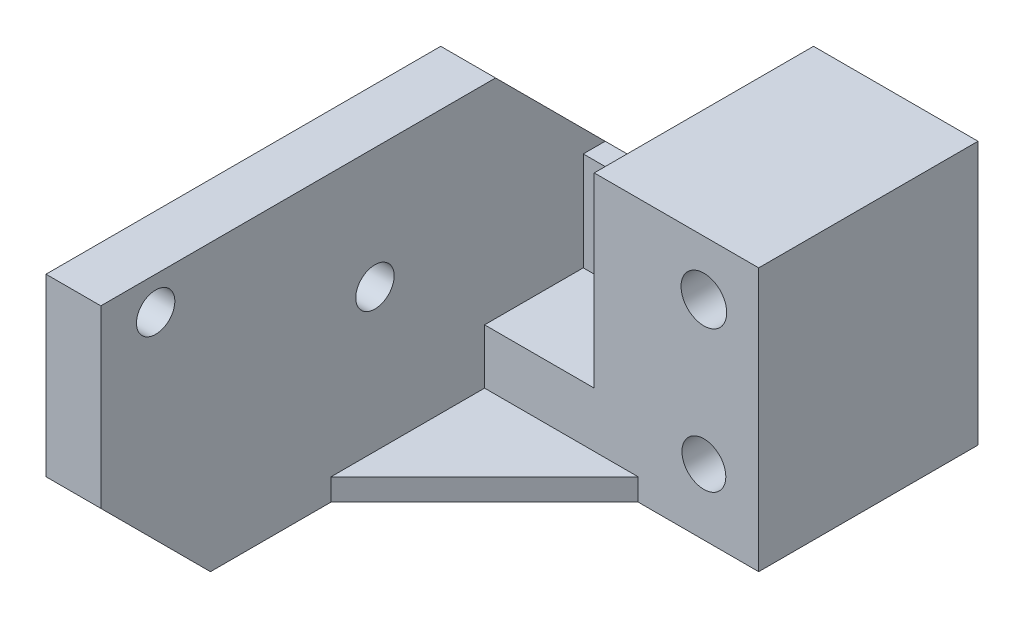
ISO-10303-21;
HEADER;
FILE_DESCRIPTION(('STEP AP214'),'2;1');
FILE_NAME('part.step','',(''),(''),'','','');
FILE_SCHEMA(('AUTOMOTIVE_DESIGN { 1 0 10303 214 1 1 1 1 }'));
ENDSEC;
DATA;
#1=APPLICATION_CONTEXT('core data for automotive mechanical design processes');
#2=APPLICATION_PROTOCOL_DEFINITION('international standard','automotive_design',2000,#1);
#3=PRODUCT_CONTEXT('',#1,'mechanical');
#4=PRODUCT('Part','Part','',(#3));
#5=PRODUCT_RELATED_PRODUCT_CATEGORY('part','',(#4));
#6=PRODUCT_DEFINITION_FORMATION('','',#4);
#7=PRODUCT_DEFINITION_CONTEXT('part definition',#1,'design');
#8=PRODUCT_DEFINITION('design','',#6,#7);
#9=PRODUCT_DEFINITION_SHAPE('','',#8);
#10=(LENGTH_UNIT() NAMED_UNIT(*) SI_UNIT(.MILLI.,.METRE.));
#11=(NAMED_UNIT(*) PLANE_ANGLE_UNIT() SI_UNIT($,.RADIAN.));
#12=(NAMED_UNIT(*) SI_UNIT($,.STERADIAN.) SOLID_ANGLE_UNIT());
#13=UNCERTAINTY_MEASURE_WITH_UNIT(LENGTH_MEASURE(1.E-05),#10,'distance_accuracy_value','');
#14=(GEOMETRIC_REPRESENTATION_CONTEXT(3) GLOBAL_UNCERTAINTY_ASSIGNED_CONTEXT((#13)) GLOBAL_UNIT_ASSIGNED_CONTEXT((#10,
#11,#12)) REPRESENTATION_CONTEXT('',''));
#15=CARTESIAN_POINT('',(0.,0.,0.));
#16=DIRECTION('',(0.,0.,1.));
#17=DIRECTION('',(1.,0.,0.));
#18=AXIS2_PLACEMENT_3D('',#15,#16,#17);
#19=CARTESIAN_POINT('',(30.,12.,0.));
#20=DIRECTION('',(0.,0.,-1.));
#21=DIRECTION('',(-1.,0.,0.));
#22=AXIS2_PLACEMENT_3D('',#19,#20,#21);
#23=PLANE('',#22);
#24=CARTESIAN_POINT('',(25.,19.,0.));
#25=DIRECTION('',(0.,0.,1.));
#26=DIRECTION('',(1.,0.,0.));
#27=AXIS2_PLACEMENT_3D('',#24,#25,#26);
#28=CIRCLE('',#27,2.08412794298633);
#29=CARTESIAN_POINT('',(27.0841279429863,19.,0.));
#30=VERTEX_POINT('',#29);
#31=EDGE_CURVE('E175',#30,#30,#28,.T.);
#32=ORIENTED_EDGE('',*,*,#31,.F.);
#33=EDGE_LOOP('',(#32));
#34=FACE_BOUND('',#33,.T.);
#35=CARTESIAN_POINT('',(25.,6.,0.));
#36=DIRECTION('',(0.,0.,1.));
#37=DIRECTION('',(1.,0.,0.));
#38=AXIS2_PLACEMENT_3D('',#35,#36,#37);
#39=CIRCLE('',#38,2.);
#40=CARTESIAN_POINT('',(27.,6.,0.));
#41=VERTEX_POINT('',#40);
#42=EDGE_CURVE('E183',#41,#41,#39,.T.);
#43=ORIENTED_EDGE('',*,*,#42,.F.);
#44=EDGE_LOOP('',(#43));
#45=FACE_BOUND('',#44,.T.);
#46=DIRECTION('',(0.,-1.,0.));
#47=VECTOR('',#46,1.);
#48=CARTESIAN_POINT('',(15.,24.,0.));
#49=LINE('',#48,#47);
#50=CARTESIAN_POINT('',(15.,24.,0.));
#51=VERTEX_POINT('',#50);
#52=CARTESIAN_POINT('',(15.,7.,0.));
#53=VERTEX_POINT('',#52);
#54=EDGE_CURVE('E174',#51,#53,#49,.T.);
#55=ORIENTED_EDGE('',*,*,#54,.T.);
#56=DIRECTION('',(-1.,0.,0.));
#57=VECTOR('',#56,1.);
#58=CARTESIAN_POINT('',(30.,7.,0.));
#59=LINE('',#58,#57);
#60=CARTESIAN_POINT('',(5.,7.,0.));
#61=VERTEX_POINT('',#60);
#62=EDGE_CURVE('E160',#53,#61,#59,.T.);
#63=ORIENTED_EDGE('',*,*,#62,.T.);
#64=DIRECTION('',(0.,-1.,0.));
#65=VECTOR('',#64,1.);
#66=CARTESIAN_POINT('',(5.,12.,0.));
#67=LINE('',#66,#65);
#68=CARTESIAN_POINT('',(5.,2.,0.));
#69=VERTEX_POINT('',#68);
#70=EDGE_CURVE('E171',#61,#69,#67,.T.);
#71=ORIENTED_EDGE('',*,*,#70,.T.);
#72=DIRECTION('',(1.,0.,0.));
#73=VECTOR('',#72,1.);
#74=CARTESIAN_POINT('',(19.,2.,0.));
#75=LINE('',#74,#73);
#76=CARTESIAN_POINT('',(19.,2.,0.));
#77=VERTEX_POINT('',#76);
#78=EDGE_CURVE('E291',#69,#77,#75,.T.);
#79=ORIENTED_EDGE('',*,*,#78,.T.);
#80=DIRECTION('',(0.,-1.,0.));
#81=VECTOR('',#80,1.);
#82=CARTESIAN_POINT('',(19.,2.,0.));
#83=LINE('',#82,#81);
#84=CARTESIAN_POINT('',(19.,0.,0.));
#85=VERTEX_POINT('',#84);
#86=EDGE_CURVE('E296',#77,#85,#83,.T.);
#87=ORIENTED_EDGE('',*,*,#86,.T.);
#88=DIRECTION('',(1.,0.,0.));
#89=VECTOR('',#88,1.);
#90=CARTESIAN_POINT('',(30.,0.,0.));
#91=LINE('',#90,#89);
#92=CARTESIAN_POINT('',(30.,0.,0.));
#93=VERTEX_POINT('',#92);
#94=EDGE_CURVE('E196',#85,#93,#91,.T.);
#95=ORIENTED_EDGE('',*,*,#94,.T.);
#96=DIRECTION('',(0.,-1.,0.));
#97=VECTOR('',#96,1.);
#98=CARTESIAN_POINT('',(30.,12.,0.));
#99=LINE('',#98,#97);
#100=CARTESIAN_POINT('',(30.,24.,0.));
#101=VERTEX_POINT('',#100);
#102=EDGE_CURVE('E212',#101,#93,#99,.T.);
#103=ORIENTED_EDGE('',*,*,#102,.F.);
#104=DIRECTION('',(1.,0.,0.));
#105=VECTOR('',#104,1.);
#106=CARTESIAN_POINT('',(15.,24.,0.));
#107=LINE('',#106,#105);
#108=EDGE_CURVE('E279',#51,#101,#107,.T.);
#109=ORIENTED_EDGE('',*,*,#108,.F.);
#110=EDGE_LOOP('',(#55,#63,#71,#79,#87,#95,#103,#109));
#111=FACE_BOUND('',#110,.T.);
#112=ADVANCED_FACE('F35',(#34,#45,#111),#23,.F.);
#113=CARTESIAN_POINT('',(30.,12.,-20.));
#114=DIRECTION('',(-1.,0.,0.));
#115=DIRECTION('',(0.,0.,1.));
#116=AXIS2_PLACEMENT_3D('',#113,#114,#115);
#117=PLANE('',#116);
#118=DIRECTION('',(0.,0.,-1.));
#119=VECTOR('',#118,1.);
#120=CARTESIAN_POINT('',(30.,0.,-20.));
#121=LINE('',#120,#119);
#122=CARTESIAN_POINT('',(30.,0.,-20.));
#123=VERTEX_POINT('',#122);
#124=EDGE_CURVE('E198',#93,#123,#121,.T.);
#125=ORIENTED_EDGE('',*,*,#124,.T.);
#126=DIRECTION('',(0.,-1.,0.));
#127=VECTOR('',#126,1.);
#128=CARTESIAN_POINT('',(30.,12.,-20.));
#129=LINE('',#128,#127);
#130=CARTESIAN_POINT('',(30.,24.,-20.));
#131=VERTEX_POINT('',#130);
#132=EDGE_CURVE('E209',#131,#123,#129,.T.);
#133=ORIENTED_EDGE('',*,*,#132,.F.);
#134=DIRECTION('',(0.,0.,-1.));
#135=VECTOR('',#134,1.);
#136=CARTESIAN_POINT('',(30.,24.,-20.));
#137=LINE('',#136,#135);
#138=EDGE_CURVE('E282',#101,#131,#137,.T.);
#139=ORIENTED_EDGE('',*,*,#138,.F.);
#140=ORIENTED_EDGE('',*,*,#102,.T.);
#141=EDGE_LOOP('',(#125,#133,#139,#140));
#142=FACE_BOUND('',#141,.T.);
#143=ADVANCED_FACE('F366',(#142),#117,.F.);
#144=CARTESIAN_POINT('',(15.,12.,-20.));
#145=DIRECTION('',(0.,0.,1.));
#146=DIRECTION('',(1.,0.,0.));
#147=AXIS2_PLACEMENT_3D('',#144,#145,#146);
#148=PLANE('',#147);
#149=CARTESIAN_POINT('',(25.,19.,-20.));
#150=DIRECTION('',(0.,0.,1.));
#151=DIRECTION('',(1.,0.,0.));
#152=AXIS2_PLACEMENT_3D('',#149,#150,#151);
#153=CIRCLE('',#152,2.08412794298633);
#154=CARTESIAN_POINT('',(27.0841279429863,19.,-20.));
#155=VERTEX_POINT('',#154);
#156=EDGE_CURVE('E271',#155,#155,#153,.T.);
#157=ORIENTED_EDGE('',*,*,#156,.T.);
#158=EDGE_LOOP('',(#157));
#159=FACE_BOUND('',#158,.T.);
#160=CARTESIAN_POINT('',(25.,6.,-20.));
#161=DIRECTION('',(0.,0.,1.));
#162=DIRECTION('',(1.,0.,0.));
#163=AXIS2_PLACEMENT_3D('',#160,#161,#162);
#164=CIRCLE('',#163,2.);
#165=CARTESIAN_POINT('',(27.,6.,-20.));
#166=VERTEX_POINT('',#165);
#167=EDGE_CURVE('E187',#166,#166,#164,.F.);
#168=ORIENTED_EDGE('',*,*,#167,.F.);
#169=EDGE_LOOP('',(#168));
#170=FACE_BOUND('',#169,.T.);
#171=DIRECTION('',(-1.,0.,0.));
#172=VECTOR('',#171,1.);
#173=CARTESIAN_POINT('',(15.,0.,-20.));
#174=LINE('',#173,#172);
#175=CARTESIAN_POINT('',(15.,0.,-20.));
#176=VERTEX_POINT('',#175);
#177=EDGE_CURVE('E200',#123,#176,#174,.T.);
#178=ORIENTED_EDGE('',*,*,#177,.T.);
#179=DIRECTION('',(0.,-1.,0.));
#180=VECTOR('',#179,1.);
#181=CARTESIAN_POINT('',(15.,12.,-20.));
#182=LINE('',#181,#180);
#183=CARTESIAN_POINT('',(15.,24.,-20.));
#184=VERTEX_POINT('',#183);
#185=EDGE_CURVE('E207',#184,#176,#182,.T.);
#186=ORIENTED_EDGE('',*,*,#185,.F.);
#187=DIRECTION('',(-1.,0.,0.));
#188=VECTOR('',#187,1.);
#189=CARTESIAN_POINT('',(15.,24.,-20.));
#190=LINE('',#189,#188);
#191=EDGE_CURVE('E285',#131,#184,#190,.T.);
#192=ORIENTED_EDGE('',*,*,#191,.F.);
#193=ORIENTED_EDGE('',*,*,#132,.T.);
#194=EDGE_LOOP('',(#178,#186,#192,#193));
#195=FACE_BOUND('',#194,.T.);
#196=ADVANCED_FACE('F372',(#159,#170,#195),#148,.F.);
#197=CARTESIAN_POINT('',(15.,12.,-11.));
#198=DIRECTION('',(1.,0.,0.));
#199=DIRECTION('',(0.,0.,-1.));
#200=AXIS2_PLACEMENT_3D('',#197,#198,#199);
#201=PLANE('',#200);
#202=DIRECTION('',(0.,0.,-1.));
#203=VECTOR('',#202,1.);
#204=CARTESIAN_POINT('',(15.,16.,-9.00000000000001));
#205=LINE('',#204,#203);
#206=CARTESIAN_POINT('',(15.,16.,-9.00000000000001));
#207=VERTEX_POINT('',#206);
#208=CARTESIAN_POINT('',(15.,16.,-11.));
#209=VERTEX_POINT('',#208);
#210=EDGE_CURVE('E266',#207,#209,#205,.T.);
#211=ORIENTED_EDGE('',*,*,#210,.F.);
#212=DIRECTION('',(0.,-1.,0.));
#213=VECTOR('',#212,1.);
#214=CARTESIAN_POINT('',(15.,16.,-9.00000000000001));
#215=LINE('',#214,#213);
#216=CARTESIAN_POINT('',(15.,7.,-9.00000000000001));
#217=VERTEX_POINT('',#216);
#218=EDGE_CURVE('E450',#207,#217,#215,.T.);
#219=ORIENTED_EDGE('',*,*,#218,.T.);
#220=DIRECTION('',(0.,0.,-1.));
#221=VECTOR('',#220,1.);
#222=CARTESIAN_POINT('',(15.,7.,35.));
#223=LINE('',#222,#221);
#224=EDGE_CURVE('E167',#53,#217,#223,.T.);
#225=ORIENTED_EDGE('',*,*,#224,.F.);
#226=ORIENTED_EDGE('',*,*,#54,.F.);
#227=DIRECTION('',(0.,0.,1.));
#228=VECTOR('',#227,1.);
#229=CARTESIAN_POINT('',(15.,24.,-20.));
#230=LINE('',#229,#228);
#231=EDGE_CURVE('E274',#184,#51,#230,.T.);
#232=ORIENTED_EDGE('',*,*,#231,.F.);
#233=ORIENTED_EDGE('',*,*,#185,.T.);
#234=DIRECTION('',(0.,0.,1.));
#235=VECTOR('',#234,1.);
#236=CARTESIAN_POINT('',(15.,0.,-11.));
#237=LINE('',#236,#235);
#238=CARTESIAN_POINT('',(15.,0.,-6.99999999999999));
#239=VERTEX_POINT('',#238);
#240=EDGE_CURVE('E50',#176,#239,#237,.T.);
#241=ORIENTED_EDGE('',*,*,#240,.T.);
#242=DIRECTION('',(0.,0.707106781186546,-0.707106781186549));
#243=VECTOR('',#242,1.);
#244=CARTESIAN_POINT('',(15.,7.99999999999999,-15.));
#245=LINE('',#244,#243);
#246=CARTESIAN_POINT('',(15.,4.,-11.));
#247=VERTEX_POINT('',#246);
#248=EDGE_CURVE('E11',#239,#247,#245,.T.);
#249=ORIENTED_EDGE('',*,*,#248,.T.);
#250=DIRECTION('',(0.,-1.,0.));
#251=VECTOR('',#250,1.);
#252=CARTESIAN_POINT('',(15.,12.,-11.));
#253=LINE('',#252,#251);
#254=EDGE_CURVE('E205',#209,#247,#253,.T.);
#255=ORIENTED_EDGE('',*,*,#254,.F.);
#256=EDGE_LOOP('',(#211,#219,#225,#226,#232,#233,#241,#249,#255));
#257=FACE_BOUND('',#256,.T.);
#258=ADVANCED_FACE('F250',(#257),#201,.F.);
#259=CARTESIAN_POINT('',(0.,12.,-11.));
#260=DIRECTION('',(0.,0.,1.));
#261=DIRECTION('',(1.,0.,0.));
#262=AXIS2_PLACEMENT_3D('',#259,#260,#261);
#263=PLANE('',#262);
#264=DIRECTION('',(-1.,0.,0.));
#265=VECTOR('',#264,1.);
#266=CARTESIAN_POINT('',(0.,4.,-11.));
#267=LINE('',#266,#265);
#268=CARTESIAN_POINT('',(4.00000000000001,4.,-11.));
#269=VERTEX_POINT('',#268);
#270=EDGE_CURVE('E58',#247,#269,#267,.T.);
#271=ORIENTED_EDGE('',*,*,#270,.T.);
#272=DIRECTION('',(0.,1.,0.));
#273=VECTOR('',#272,1.);
#274=CARTESIAN_POINT('',(4.00000000000001,12.,-11.));
#275=LINE('',#274,#273);
#276=CARTESIAN_POINT('',(4.00000000000001,16.,-11.));
#277=VERTEX_POINT('',#276);
#278=EDGE_CURVE('E238',#269,#277,#275,.T.);
#279=ORIENTED_EDGE('',*,*,#278,.T.);
#280=DIRECTION('',(1.,0.,0.));
#281=VECTOR('',#280,1.);
#282=CARTESIAN_POINT('',(5.,16.,-11.));
#283=LINE('',#282,#281);
#284=CARTESIAN_POINT('',(5.,16.,-11.));
#285=VERTEX_POINT('',#284);
#286=EDGE_CURVE('E221',#277,#285,#283,.T.);
#287=ORIENTED_EDGE('',*,*,#286,.T.);
#288=DIRECTION('',(1.,0.,0.));
#289=VECTOR('',#288,1.);
#290=CARTESIAN_POINT('',(5.,16.,-11.));
#291=LINE('',#290,#289);
#292=EDGE_CURVE('E255',#285,#209,#291,.T.);
#293=ORIENTED_EDGE('',*,*,#292,.T.);
#294=ORIENTED_EDGE('',*,*,#254,.T.);
#295=EDGE_LOOP('',(#271,#279,#287,#293,#294));
#296=FACE_BOUND('',#295,.T.);
#297=ADVANCED_FACE('F253',(#296),#263,.F.);
#298=CARTESIAN_POINT('',(0.,12.,0.));
#299=DIRECTION('',(1.,0.,0.));
#300=DIRECTION('',(0.,0.,-1.));
#301=AXIS2_PLACEMENT_3D('',#298,#299,#300);
#302=PLANE('',#301);
#303=DIRECTION('',(0.,-0.707106781186549,-0.707106781186546));
#304=VECTOR('',#303,1.);
#305=CARTESIAN_POINT('',(0.,26.,-1.00000000000001));
#306=LINE('',#305,#304);
#307=CARTESIAN_POINT('',(0.,26.,-1.00000000000001));
#308=VERTEX_POINT('',#307);
#309=CARTESIAN_POINT('',(0.,20.,-6.99999999999999));
#310=VERTEX_POINT('',#309);
#311=EDGE_CURVE('E218',#308,#310,#306,.T.);
#312=ORIENTED_EDGE('',*,*,#311,.T.);
#313=DIRECTION('',(0.,-1.,0.));
#314=VECTOR('',#313,1.);
#315=CARTESIAN_POINT('',(0.,12.,-6.99999999999999));
#316=LINE('',#315,#314);
#317=CARTESIAN_POINT('',(0.,0.,-6.99999999999999));
#318=VERTEX_POINT('',#317);
#319=EDGE_CURVE('E234',#310,#318,#316,.T.);
#320=ORIENTED_EDGE('',*,*,#319,.T.);
#321=DIRECTION('',(0.,0.,1.));
#322=VECTOR('',#321,1.);
#323=CARTESIAN_POINT('',(0.,0.,0.));
#324=LINE('',#323,#322);
#325=CARTESIAN_POINT('',(0.,0.,25.));
#326=VERTEX_POINT('',#325);
#327=EDGE_CURVE('E203',#318,#326,#324,.T.);
#328=ORIENTED_EDGE('',*,*,#327,.T.);
#329=DIRECTION('',(0.,-0.707106781186549,-0.707106781186546));
#330=VECTOR('',#329,1.);
#331=CARTESIAN_POINT('',(0.,0.,25.));
#332=LINE('',#331,#330);
#333=CARTESIAN_POINT('',(0.,10.,35.));
#334=VERTEX_POINT('',#333);
#335=EDGE_CURVE('E228',#326,#334,#332,.F.);
#336=ORIENTED_EDGE('',*,*,#335,.T.);
#337=DIRECTION('',(0.,1.,0.));
#338=VECTOR('',#337,1.);
#339=CARTESIAN_POINT('',(0.,0.,35.));
#340=LINE('',#339,#338);
#341=CARTESIAN_POINT('',(0.,26.,35.));
#342=VERTEX_POINT('',#341);
#343=EDGE_CURVE('E313',#334,#342,#340,.T.);
#344=ORIENTED_EDGE('',*,*,#343,.T.);
#345=DIRECTION('',(0.,0.,-1.));
#346=VECTOR('',#345,1.);
#347=CARTESIAN_POINT('',(0.,26.,-11.));
#348=LINE('',#347,#346);
#349=EDGE_CURVE('E320',#342,#308,#348,.T.);
#350=ORIENTED_EDGE('',*,*,#349,.T.);
#351=EDGE_LOOP('',(#312,#320,#328,#336,#344,#350));
#352=FACE_BOUND('',#351,.T.);
#353=CARTESIAN_POINT('',(0.,15.,10.));
#354=DIRECTION('',(-1.,0.,0.));
#355=DIRECTION('',(0.,0.,1.));
#356=AXIS2_PLACEMENT_3D('',#353,#354,#355);
#357=CIRCLE('',#356,1.75);
#358=CARTESIAN_POINT('',(0.,15.,11.75));
#359=VERTEX_POINT('',#358);
#360=EDGE_CURVE('E301',#359,#359,#357,.T.);
#361=ORIENTED_EDGE('',*,*,#360,.F.);
#362=EDGE_LOOP('',(#361));
#363=FACE_BOUND('',#362,.T.);
#364=CARTESIAN_POINT('',(0.,23.,30.));
#365=DIRECTION('',(-1.,0.,0.));
#366=DIRECTION('',(0.,0.,1.));
#367=AXIS2_PLACEMENT_3D('',#364,#365,#366);
#368=CIRCLE('',#367,1.75);
#369=CARTESIAN_POINT('',(0.,23.,31.75));
#370=VERTEX_POINT('',#369);
#371=EDGE_CURVE('E307',#370,#370,#368,.T.);
#372=ORIENTED_EDGE('',*,*,#371,.F.);
#373=EDGE_LOOP('',(#372));
#374=FACE_BOUND('',#373,.T.);
#375=ADVANCED_FACE('F327',(#352,#363,#374),#302,.F.);
#376=CARTESIAN_POINT('',(0.,0.,0.));
#377=DIRECTION('',(0.,-1.,0.));
#378=DIRECTION('',(0.,0.,-1.));
#379=AXIS2_PLACEMENT_3D('',#376,#377,#378);
#380=PLANE('',#379);
#381=ORIENTED_EDGE('',*,*,#327,.F.);
#382=DIRECTION('',(1.,0.,0.));
#383=VECTOR('',#382,1.);
#384=CARTESIAN_POINT('',(15.,0.,-6.99999999999999));
#385=LINE('',#384,#383);
#386=EDGE_CURVE('E44',#318,#239,#385,.T.);
#387=ORIENTED_EDGE('',*,*,#386,.T.);
#388=ORIENTED_EDGE('',*,*,#240,.F.);
#389=ORIENTED_EDGE('',*,*,#177,.F.);
#390=ORIENTED_EDGE('',*,*,#124,.F.);
#391=ORIENTED_EDGE('',*,*,#94,.F.);
#392=DIRECTION('',(-0.707106781186547,0.,0.707106781186547));
#393=VECTOR('',#392,1.);
#394=CARTESIAN_POINT('',(5.,0.,14.));
#395=LINE('',#394,#393);
#396=CARTESIAN_POINT('',(5.,0.,14.));
#397=VERTEX_POINT('',#396);
#398=EDGE_CURVE('E289',#85,#397,#395,.T.);
#399=ORIENTED_EDGE('',*,*,#398,.T.);
#400=DIRECTION('',(0.,0.,1.));
#401=VECTOR('',#400,1.);
#402=CARTESIAN_POINT('',(5.,0.,-11.));
#403=LINE('',#402,#401);
#404=CARTESIAN_POINT('',(4.99999999999999,0.,25.));
#405=VERTEX_POINT('',#404);
#406=EDGE_CURVE('E316',#397,#405,#403,.T.);
#407=ORIENTED_EDGE('',*,*,#406,.T.);
#408=DIRECTION('',(-1.,0.,0.));
#409=VECTOR('',#408,1.);
#410=CARTESIAN_POINT('',(0.,0.,25.));
#411=LINE('',#410,#409);
#412=EDGE_CURVE('E225',#405,#326,#411,.T.);
#413=ORIENTED_EDGE('',*,*,#412,.T.);
#414=EDGE_LOOP('',(#381,#387,#388,#389,#390,#391,#399,#407,#413));
#415=FACE_BOUND('',#414,.T.);
#416=ADVANCED_FACE('F246',(#415),#380,.T.);
#417=CARTESIAN_POINT('',(25.,6.,-20.001));
#418=DIRECTION('',(0.,0.,1.));
#419=DIRECTION('',(1.,0.,0.));
#420=AXIS2_PLACEMENT_3D('',#417,#418,#419);
#421=CYLINDRICAL_SURFACE('',#420,2.);
#422=ORIENTED_EDGE('',*,*,#42,.T.);
#423=EDGE_LOOP('',(#422));
#424=FACE_BOUND('',#423,.T.);
#425=ORIENTED_EDGE('',*,*,#167,.T.);
#426=EDGE_LOOP('',(#425));
#427=FACE_BOUND('',#426,.T.);
#428=ADVANCED_FACE('F420',(#424,#427),#421,.F.);
#429=CARTESIAN_POINT('',(5.,0.,0.));
#430=DIRECTION('',(1.,0.,0.));
#431=DIRECTION('',(0.,0.,-1.));
#432=AXIS2_PLACEMENT_3D('',#429,#430,#431);
#433=PLANE('',#432);
#434=DIRECTION('',(0.,0.,-1.));
#435=VECTOR('',#434,1.);
#436=CARTESIAN_POINT('',(5.,16.,-9.00000000000001));
#437=LINE('',#436,#435);
#438=CARTESIAN_POINT('',(5.,16.,-9.00000000000001));
#439=VERTEX_POINT('',#438);
#440=EDGE_CURVE('E268',#439,#285,#437,.T.);
#441=ORIENTED_EDGE('',*,*,#440,.T.);
#442=DIRECTION('',(0.,0.707106781186549,0.707106781186546));
#443=VECTOR('',#442,1.);
#444=CARTESIAN_POINT('',(5.,13.5,-13.5));
#445=LINE('',#444,#443);
#446=CARTESIAN_POINT('',(5.,26.,-1.00000000000001));
#447=VERTEX_POINT('',#446);
#448=EDGE_CURVE('E223',#285,#447,#445,.T.);
#449=ORIENTED_EDGE('',*,*,#448,.T.);
#450=DIRECTION('',(0.,0.,-1.));
#451=VECTOR('',#450,1.);
#452=CARTESIAN_POINT('',(5.,26.,-11.));
#453=LINE('',#452,#451);
#454=CARTESIAN_POINT('',(4.99999999999999,26.,35.));
#455=VERTEX_POINT('',#454);
#456=EDGE_CURVE('E190',#455,#447,#453,.T.);
#457=ORIENTED_EDGE('',*,*,#456,.F.);
#458=DIRECTION('',(0.,1.,0.));
#459=VECTOR('',#458,1.);
#460=CARTESIAN_POINT('',(4.99999999999999,0.,35.));
#461=LINE('',#460,#459);
#462=CARTESIAN_POINT('',(4.99999999999999,10.,35.));
#463=VERTEX_POINT('',#462);
#464=EDGE_CURVE('E319',#463,#455,#461,.T.);
#465=ORIENTED_EDGE('',*,*,#464,.F.);
#466=DIRECTION('',(0.,0.707106781186549,0.707106781186546));
#467=VECTOR('',#466,1.);
#468=CARTESIAN_POINT('',(5.,-12.5,12.5000000000001));
#469=LINE('',#468,#467);
#470=EDGE_CURVE('E232',#463,#405,#469,.F.);
#471=ORIENTED_EDGE('',*,*,#470,.T.);
#472=ORIENTED_EDGE('',*,*,#406,.F.);
#473=DIRECTION('',(0.,-1.,0.));
#474=VECTOR('',#473,1.);
#475=CARTESIAN_POINT('',(5.,2.,14.));
#476=LINE('',#475,#474);
#477=CARTESIAN_POINT('',(5.,2.,14.));
#478=VERTEX_POINT('',#477);
#479=EDGE_CURVE('E298',#478,#397,#476,.T.);
#480=ORIENTED_EDGE('',*,*,#479,.F.);
#481=DIRECTION('',(0.,0.,-1.));
#482=VECTOR('',#481,1.);
#483=CARTESIAN_POINT('',(5.,2.,0.));
#484=LINE('',#483,#482);
#485=EDGE_CURVE('E182',#478,#69,#484,.T.);
#486=ORIENTED_EDGE('',*,*,#485,.T.);
#487=ORIENTED_EDGE('',*,*,#70,.F.);
#488=DIRECTION('',(0.,0.,-1.));
#489=VECTOR('',#488,1.);
#490=CARTESIAN_POINT('',(4.99999999999999,7.,35.));
#491=LINE('',#490,#489);
#492=CARTESIAN_POINT('',(5.,7.,-9.00000000000001));
#493=VERTEX_POINT('',#492);
#494=EDGE_CURVE('E156',#61,#493,#491,.T.);
#495=ORIENTED_EDGE('',*,*,#494,.T.);
#496=DIRECTION('',(0.,1.,0.));
#497=VECTOR('',#496,1.);
#498=CARTESIAN_POINT('',(5.,16.,-9.00000000000001));
#499=LINE('',#498,#497);
#500=EDGE_CURVE('E259',#493,#439,#499,.T.);
#501=ORIENTED_EDGE('',*,*,#500,.T.);
#502=EDGE_LOOP('',(#441,#449,#457,#465,#471,#472,#480,#486,#487,#495,#501));
#503=FACE_BOUND('',#502,.T.);
#504=CARTESIAN_POINT('',(4.99999999999999,23.,30.));
#505=DIRECTION('',(-1.,0.,0.));
#506=DIRECTION('',(0.,0.,1.));
#507=AXIS2_PLACEMENT_3D('',#504,#505,#506);
#508=CIRCLE('',#507,1.75);
#509=CARTESIAN_POINT('',(4.99999999999999,23.,31.75));
#510=VERTEX_POINT('',#509);
#511=EDGE_CURVE('E310',#510,#510,#508,.T.);
#512=ORIENTED_EDGE('',*,*,#511,.T.);
#513=EDGE_LOOP('',(#512));
#514=FACE_BOUND('',#513,.T.);
#515=CARTESIAN_POINT('',(5.,15.,10.));
#516=DIRECTION('',(-1.,0.,0.));
#517=DIRECTION('',(0.,0.,1.));
#518=AXIS2_PLACEMENT_3D('',#515,#516,#517);
#519=CIRCLE('',#518,1.75);
#520=CARTESIAN_POINT('',(5.,15.,11.75));
#521=VERTEX_POINT('',#520);
#522=EDGE_CURVE('E304',#521,#521,#519,.T.);
#523=ORIENTED_EDGE('',*,*,#522,.T.);
#524=EDGE_LOOP('',(#523));
#525=FACE_BOUND('',#524,.T.);
#526=ADVANCED_FACE('F179',(#503,#514,#525),#433,.T.);
#527=CARTESIAN_POINT('',(5.,26.,-11.));
#528=DIRECTION('',(0.,1.,0.));
#529=DIRECTION('',(0.,0.,1.));
#530=AXIS2_PLACEMENT_3D('',#527,#528,#529);
#531=PLANE('',#530);
#532=ORIENTED_EDGE('',*,*,#456,.T.);
#533=DIRECTION('',(-1.,0.,0.));
#534=VECTOR('',#533,1.);
#535=CARTESIAN_POINT('',(0.,26.,-1.00000000000001));
#536=LINE('',#535,#534);
#537=EDGE_CURVE('E215',#447,#308,#536,.T.);
#538=ORIENTED_EDGE('',*,*,#537,.T.);
#539=ORIENTED_EDGE('',*,*,#349,.F.);
#540=DIRECTION('',(-1.,0.,0.));
#541=VECTOR('',#540,1.);
#542=CARTESIAN_POINT('',(4.99999999999999,26.,35.));
#543=LINE('',#542,#541);
#544=EDGE_CURVE('E184',#455,#342,#543,.T.);
#545=ORIENTED_EDGE('',*,*,#544,.F.);
#546=EDGE_LOOP('',(#532,#538,#539,#545));
#547=FACE_BOUND('',#546,.T.);
#548=ADVANCED_FACE('F333',(#547),#531,.T.);
#549=CARTESIAN_POINT('',(4.99999999999999,0.,35.));
#550=DIRECTION('',(0.,0.,1.));
#551=DIRECTION('',(1.,0.,0.));
#552=AXIS2_PLACEMENT_3D('',#549,#550,#551);
#553=PLANE('',#552);
#554=ORIENTED_EDGE('',*,*,#343,.F.);
#555=DIRECTION('',(1.,0.,0.));
#556=VECTOR('',#555,1.);
#557=CARTESIAN_POINT('',(4.99999999999999,10.,35.));
#558=LINE('',#557,#556);
#559=EDGE_CURVE('E230',#334,#463,#558,.T.);
#560=ORIENTED_EDGE('',*,*,#559,.T.);
#561=ORIENTED_EDGE('',*,*,#464,.T.);
#562=ORIENTED_EDGE('',*,*,#544,.T.);
#563=EDGE_LOOP('',(#554,#560,#561,#562));
#564=FACE_BOUND('',#563,.T.);
#565=ADVANCED_FACE('F352',(#564),#553,.T.);
#566=CARTESIAN_POINT('',(4.99999999999999,23.,30.));
#567=DIRECTION('',(-1.,0.,0.));
#568=DIRECTION('',(0.,0.,1.));
#569=AXIS2_PLACEMENT_3D('',#566,#567,#568);
#570=CYLINDRICAL_SURFACE('',#569,1.75);
#571=ORIENTED_EDGE('',*,*,#511,.F.);
#572=EDGE_LOOP('',(#571));
#573=FACE_BOUND('',#572,.T.);
#574=ORIENTED_EDGE('',*,*,#371,.T.);
#575=EDGE_LOOP('',(#574));
#576=FACE_BOUND('',#575,.T.);
#577=ADVANCED_FACE('F354',(#573,#576),#570,.F.);
#578=CARTESIAN_POINT('',(5.,15.,10.));
#579=DIRECTION('',(-1.,0.,0.));
#580=DIRECTION('',(0.,0.,1.));
#581=AXIS2_PLACEMENT_3D('',#578,#579,#580);
#582=CYLINDRICAL_SURFACE('',#581,1.75);
#583=ORIENTED_EDGE('',*,*,#522,.F.);
#584=EDGE_LOOP('',(#583));
#585=FACE_BOUND('',#584,.T.);
#586=ORIENTED_EDGE('',*,*,#360,.T.);
#587=EDGE_LOOP('',(#586));
#588=FACE_BOUND('',#587,.T.);
#589=ADVANCED_FACE('F360',(#585,#588),#582,.F.);
#590=CARTESIAN_POINT('',(5.,26.,-1.00000000000001));
#591=DIRECTION('',(0.,0.707106781186546,-0.707106781186549));
#592=DIRECTION('',(1.,0.,0.));
#593=AXIS2_PLACEMENT_3D('',#590,#591,#592);
#594=PLANE('',#593);
#595=ORIENTED_EDGE('',*,*,#286,.F.);
#596=DIRECTION('',(0.577350269189624,-0.577350269189628,-0.577350269189626));
#597=VECTOR('',#596,1.);
#598=CARTESIAN_POINT('',(-2.33333333333333,22.3333333333333,-4.66666666666665));
#599=LINE('',#598,#597);
#600=EDGE_CURVE('E240',#277,#310,#599,.F.);
#601=ORIENTED_EDGE('',*,*,#600,.T.);
#602=ORIENTED_EDGE('',*,*,#311,.F.);
#603=ORIENTED_EDGE('',*,*,#537,.F.);
#604=ORIENTED_EDGE('',*,*,#448,.F.);
#605=EDGE_LOOP('',(#595,#601,#602,#603,#604));
#606=FACE_BOUND('',#605,.T.);
#607=ADVANCED_FACE('F338',(#606),#594,.T.);
#608=CARTESIAN_POINT('',(5.,2.,14.));
#609=DIRECTION('',(0.707106781186547,0.,0.707106781186547));
#610=DIRECTION('',(0.707106781186548,0.,-0.707106781186548));
#611=AXIS2_PLACEMENT_3D('',#608,#609,#610);
#612=PLANE('',#611);
#613=ORIENTED_EDGE('',*,*,#398,.F.);
#614=ORIENTED_EDGE('',*,*,#86,.F.);
#615=DIRECTION('',(-0.707106781186547,0.,0.707106781186547));
#616=VECTOR('',#615,1.);
#617=CARTESIAN_POINT('',(5.,2.,14.));
#618=LINE('',#617,#616);
#619=EDGE_CURVE('E293',#77,#478,#618,.T.);
#620=ORIENTED_EDGE('',*,*,#619,.T.);
#621=ORIENTED_EDGE('',*,*,#479,.T.);
#622=EDGE_LOOP('',(#613,#614,#620,#621));
#623=FACE_BOUND('',#622,.T.);
#624=ADVANCED_FACE('F381',(#623),#612,.T.);
#625=CARTESIAN_POINT('',(0.,2.,0.));
#626=DIRECTION('',(0.,-1.,0.));
#627=DIRECTION('',(0.,0.,-1.));
#628=AXIS2_PLACEMENT_3D('',#625,#626,#627);
#629=PLANE('',#628);
#630=ORIENTED_EDGE('',*,*,#485,.F.);
#631=ORIENTED_EDGE('',*,*,#619,.F.);
#632=ORIENTED_EDGE('',*,*,#78,.F.);
#633=EDGE_LOOP('',(#630,#631,#632));
#634=FACE_BOUND('',#633,.T.);
#635=ADVANCED_FACE('F384',(#634),#629,.F.);
#636=CARTESIAN_POINT('',(0.,0.,25.));
#637=DIRECTION('',(0.,0.707106781186546,-0.707106781186549));
#638=DIRECTION('',(-1.,0.,0.));
#639=AXIS2_PLACEMENT_3D('',#636,#637,#638);
#640=PLANE('',#639);
#641=ORIENTED_EDGE('',*,*,#470,.F.);
#642=ORIENTED_EDGE('',*,*,#559,.F.);
#643=ORIENTED_EDGE('',*,*,#335,.F.);
#644=ORIENTED_EDGE('',*,*,#412,.F.);
#645=EDGE_LOOP('',(#641,#642,#643,#644));
#646=FACE_BOUND('',#645,.T.);
#647=ADVANCED_FACE('F347',(#646),#640,.F.);
#648=CARTESIAN_POINT('',(0.,24.,0.));
#649=DIRECTION('',(0.,1.,0.));
#650=DIRECTION('',(0.,0.,1.));
#651=AXIS2_PLACEMENT_3D('',#648,#649,#650);
#652=PLANE('',#651);
#653=ORIENTED_EDGE('',*,*,#231,.T.);
#654=ORIENTED_EDGE('',*,*,#108,.T.);
#655=ORIENTED_EDGE('',*,*,#138,.T.);
#656=ORIENTED_EDGE('',*,*,#191,.T.);
#657=EDGE_LOOP('',(#653,#654,#655,#656));
#658=FACE_BOUND('',#657,.T.);
#659=ADVANCED_FACE('F383',(#658),#652,.T.);
#660=CARTESIAN_POINT('',(25.,19.,-20.));
#661=DIRECTION('',(0.,0.,1.));
#662=DIRECTION('',(1.,0.,0.));
#663=AXIS2_PLACEMENT_3D('',#660,#661,#662);
#664=CYLINDRICAL_SURFACE('',#663,2.08412794298633);
#665=ORIENTED_EDGE('',*,*,#156,.F.);
#666=EDGE_LOOP('',(#665));
#667=FACE_BOUND('',#666,.T.);
#668=ORIENTED_EDGE('',*,*,#31,.T.);
#669=EDGE_LOOP('',(#668));
#670=FACE_BOUND('',#669,.T.);
#671=ADVANCED_FACE('F403',(#667,#670),#664,.F.);
#672=CARTESIAN_POINT('',(15.,7.,35.));
#673=DIRECTION('',(0.,-1.,0.));
#674=DIRECTION('',(0.,0.,-1.));
#675=AXIS2_PLACEMENT_3D('',#672,#673,#674);
#676=PLANE('',#675);
#677=ORIENTED_EDGE('',*,*,#224,.T.);
#678=DIRECTION('',(-1.,0.,0.));
#679=VECTOR('',#678,1.);
#680=CARTESIAN_POINT('',(5.,7.,-9.00000000000001));
#681=LINE('',#680,#679);
#682=EDGE_CURVE('E163',#217,#493,#681,.T.);
#683=ORIENTED_EDGE('',*,*,#682,.T.);
#684=ORIENTED_EDGE('',*,*,#494,.F.);
#685=ORIENTED_EDGE('',*,*,#62,.F.);
#686=EDGE_LOOP('',(#677,#683,#684,#685));
#687=FACE_BOUND('',#686,.T.);
#688=ADVANCED_FACE('F159',(#687),#676,.F.);
#689=CARTESIAN_POINT('',(5.,16.,-9.00000000000001));
#690=DIRECTION('',(0.,1.,0.));
#691=DIRECTION('',(0.,0.,1.));
#692=AXIS2_PLACEMENT_3D('',#689,#690,#691);
#693=PLANE('',#692);
#694=ORIENTED_EDGE('',*,*,#292,.F.);
#695=ORIENTED_EDGE('',*,*,#440,.F.);
#696=DIRECTION('',(1.,0.,0.));
#697=VECTOR('',#696,1.);
#698=CARTESIAN_POINT('',(5.,16.,-9.00000000000001));
#699=LINE('',#698,#697);
#700=EDGE_CURVE('E261',#439,#207,#699,.T.);
#701=ORIENTED_EDGE('',*,*,#700,.T.);
#702=ORIENTED_EDGE('',*,*,#210,.T.);
#703=EDGE_LOOP('',(#694,#695,#701,#702));
#704=FACE_BOUND('',#703,.T.);
#705=ADVANCED_FACE('F393',(#704),#693,.T.);
#706=CARTESIAN_POINT('',(0.,0.,-9.00000000000001));
#707=DIRECTION('',(0.,0.,1.));
#708=DIRECTION('',(1.,0.,0.));
#709=AXIS2_PLACEMENT_3D('',#706,#707,#708);
#710=PLANE('',#709);
#711=ORIENTED_EDGE('',*,*,#500,.F.);
#712=ORIENTED_EDGE('',*,*,#682,.F.);
#713=ORIENTED_EDGE('',*,*,#218,.F.);
#714=ORIENTED_EDGE('',*,*,#700,.F.);
#715=EDGE_LOOP('',(#711,#712,#713,#714));
#716=FACE_BOUND('',#715,.T.);
#717=ADVANCED_FACE('F389',(#716),#710,.T.);
#718=CARTESIAN_POINT('',(0.,4.,-11.));
#719=DIRECTION('',(0.,-0.707106781186549,-0.707106781186546));
#720=DIRECTION('',(1.,0.,0.));
#721=AXIS2_PLACEMENT_3D('',#718,#719,#720);
#722=PLANE('',#721);
#723=ORIENTED_EDGE('',*,*,#248,.F.);
#724=ORIENTED_EDGE('',*,*,#386,.F.);
#725=DIRECTION('',(-0.577350269189625,-0.577350269189625,0.577350269189627));
#726=VECTOR('',#725,1.);
#727=CARTESIAN_POINT('',(2.66666666666667,2.66666666666667,-9.66666666666667));
#728=LINE('',#727,#726);
#729=EDGE_CURVE('E39',#269,#318,#728,.T.);
#730=ORIENTED_EDGE('',*,*,#729,.F.);
#731=ORIENTED_EDGE('',*,*,#270,.F.);
#732=EDGE_LOOP('',(#723,#724,#730,#731));
#733=FACE_BOUND('',#732,.T.);
#734=ADVANCED_FACE('F37',(#733),#722,.T.);
#735=CARTESIAN_POINT('',(0.,12.,-6.99999999999999));
#736=DIRECTION('',(0.707106781186549,0.,0.707106781186546));
#737=DIRECTION('',(0.,-1.,0.));
#738=AXIS2_PLACEMENT_3D('',#735,#736,#737);
#739=PLANE('',#738);
#740=ORIENTED_EDGE('',*,*,#600,.F.);
#741=ORIENTED_EDGE('',*,*,#278,.F.);
#742=ORIENTED_EDGE('',*,*,#729,.T.);
#743=ORIENTED_EDGE('',*,*,#319,.F.);
#744=EDGE_LOOP('',(#740,#741,#742,#743));
#745=FACE_BOUND('',#744,.T.);
#746=ADVANCED_FACE('F341',(#745),#739,.F.);
#747=CLOSED_SHELL('',(#112,#143,#196,#258,#297,#375,#416,#428,#526,#548,#565,#577,#589,#607,
#624,#635,#647,#659,#671,#688,#705,#717,#734,#746));
#748=MANIFOLD_SOLID_BREP('B2',#747);
#749=ADVANCED_BREP_SHAPE_REPRESENTATION('',(#18,#748),#14);
#750=SHAPE_DEFINITION_REPRESENTATION(#9,#749);
ENDSEC;
END-ISO-10303-21;
